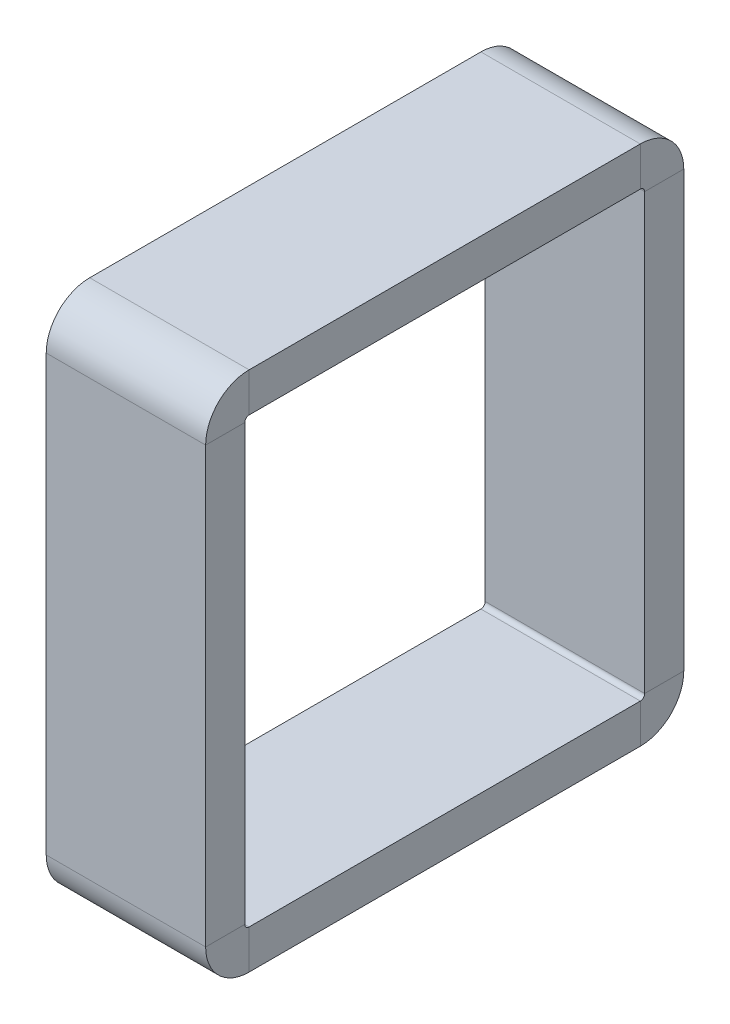
ISO-10303-21;
HEADER;
FILE_DESCRIPTION(('STEP AP214'),'2;1');
FILE_NAME('part.step','',(''),(''),'','','');
FILE_SCHEMA(('AUTOMOTIVE_DESIGN { 1 0 10303 214 1 1 1 1 }'));
ENDSEC;
DATA;
#1=APPLICATION_CONTEXT('core data for automotive mechanical design processes');
#2=APPLICATION_PROTOCOL_DEFINITION('international standard','automotive_design',2000,#1);
#3=PRODUCT_CONTEXT('',#1,'mechanical');
#4=PRODUCT('Part','Part','',(#3));
#5=PRODUCT_RELATED_PRODUCT_CATEGORY('part','',(#4));
#6=PRODUCT_DEFINITION_FORMATION('','',#4);
#7=PRODUCT_DEFINITION_CONTEXT('part definition',#1,'design');
#8=PRODUCT_DEFINITION('design','',#6,#7);
#9=PRODUCT_DEFINITION_SHAPE('','',#8);
#10=(LENGTH_UNIT() NAMED_UNIT(*) SI_UNIT(.MILLI.,.METRE.));
#11=(NAMED_UNIT(*) PLANE_ANGLE_UNIT() SI_UNIT($,.RADIAN.));
#12=(NAMED_UNIT(*) SI_UNIT($,.STERADIAN.) SOLID_ANGLE_UNIT());
#13=UNCERTAINTY_MEASURE_WITH_UNIT(LENGTH_MEASURE(1.E-05),#10,'distance_accuracy_value','');
#14=(GEOMETRIC_REPRESENTATION_CONTEXT(3) GLOBAL_UNCERTAINTY_ASSIGNED_CONTEXT((#13)) GLOBAL_UNIT_ASSIGNED_CONTEXT((#10,
#11,#12)) REPRESENTATION_CONTEXT('',''));
#15=CARTESIAN_POINT('',(0.,0.,0.));
#16=DIRECTION('',(0.,0.,1.));
#17=DIRECTION('',(1.,0.,0.));
#18=AXIS2_PLACEMENT_3D('',#15,#16,#17);
#19=CARTESIAN_POINT('',(3.71677795736335,0.75499913114187,-3.2461214549909));
#20=DIRECTION('',(-1.,1.74845553146952E-07,0.));
#21=DIRECTION('',(0.,8.74227765734758E-08,-1.));
#22=AXIS2_PLACEMENT_3D('',#19,#20,#21);
#23=PLANE('',#22);
#24=CARTESIAN_POINT('',(3.71677795648913,0.74999913157898,-3.25112145542801));
#25=DIRECTION('',(0.999999999999985,-1.74845553146949E-07,0.));
#26=DIRECTION('',(-1.74845553146948E-07,-0.999999999999981,-8.74265104755874E-08));
#27=AXIS2_PLACEMENT_3D('',#24,#25,#26);
#28=CIRCLE('',#27,0.00999999999999571);
#29=CARTESIAN_POINT('',(3.71677795474067,0.739999131578984,-3.25112145630224));
#30=VERTEX_POINT('',#29);
#31=CARTESIAN_POINT('',(3.71677795648913,0.749999132454212,-3.26112145542801));
#32=VERTEX_POINT('',#31);
#33=EDGE_CURVE('E11',#30,#32,#28,.T.);
#34=ORIENTED_EDGE('',*,*,#33,.F.);
#35=DIRECTION('',(1.74845555319994E-07,0.999999999999981,8.74227702585101E-08));
#36=VECTOR('',#35,1.);
#37=CARTESIAN_POINT('',(3.71677793900457,0.649999131579984,-3.25112146417129));
#38=LINE('',#37,#36);
#39=CARTESIAN_POINT('',(3.71677793900457,0.649999131579984,-3.25112146417029));
#40=VERTEX_POINT('',#39);
#41=EDGE_CURVE('E295',#40,#30,#38,.T.);
#42=ORIENTED_EDGE('',*,*,#41,.F.);
#43=CARTESIAN_POINT('',(3.71677795648913,0.749999131579652,-3.25112145542834));
#44=DIRECTION('',(-0.999999999999985,1.74845553146949E-07,0.));
#45=DIRECTION('',(0.,8.74165517753129E-08,-0.999999999999996));
#46=AXIS2_PLACEMENT_3D('',#43,#44,#45);
#47=CIRCLE('',#46,0.0999999999996649);
#48=CARTESIAN_POINT('',(3.71677795648913,0.749999140322262,-3.35112145542801));
#49=VERTEX_POINT('',#48);
#50=EDGE_CURVE('E292',#49,#40,#47,.T.);
#51=ORIENTED_EDGE('',*,*,#50,.F.);
#52=DIRECTION('',(0.,8.74227727247025E-08,-0.999999999999996));
#53=VECTOR('',#52,1.);
#54=CARTESIAN_POINT('',(3.71677795648913,0.749999132453212,-3.26112145542801));
#55=LINE('',#54,#53);
#56=EDGE_CURVE('E281',#32,#49,#55,.T.);
#57=ORIENTED_EDGE('',*,*,#56,.F.);
#58=EDGE_LOOP('',(#34,#42,#51,#57));
#59=FACE_BOUND('',#58,.T.);
#60=ADVANCED_FACE('F17',(#59),#23,.F.);
#61=CARTESIAN_POINT('',(3.35000013200835,0.754999195271342,-3.2461214549909));
#62=DIRECTION('',(-1.,1.74845553146952E-07,0.));
#63=DIRECTION('',(0.,8.74227765734758E-08,-1.));
#64=AXIS2_PLACEMENT_3D('',#61,#62,#63);
#65=PLANE('',#64);
#66=DIRECTION('',(0.,8.74227764254459E-08,-0.999999999999996));
#67=VECTOR('',#66,1.);
#68=CARTESIAN_POINT('',(3.35000013113413,0.749999196582683,-3.26112145542801));
#69=LINE('',#68,#67);
#70=CARTESIAN_POINT('',(3.35000013113413,0.749999196583683,-3.26112145542801));
#71=VERTEX_POINT('',#70);
#72=CARTESIAN_POINT('',(3.35000013113413,0.749999204451733,-3.35112145542801));
#73=VERTEX_POINT('',#72);
#74=EDGE_CURVE('E24',#71,#73,#69,.T.);
#75=ORIENTED_EDGE('',*,*,#74,.T.);
#76=CARTESIAN_POINT('',(3.35000013113413,0.749999195709119,-3.25112145542835));
#77=DIRECTION('',(-0.999999999999985,1.74845553146949E-07,0.));
#78=DIRECTION('',(0.,8.74161421030169E-08,-0.999999999999996));
#79=AXIS2_PLACEMENT_3D('',#76,#77,#78);
#80=CIRCLE('',#79,0.0999999999996649);
#81=CARTESIAN_POINT('',(3.35000011364957,0.649999195708455,-3.25112146417029));
#82=VERTEX_POINT('',#81);
#83=EDGE_CURVE('E290',#73,#82,#80,.T.);
#84=ORIENTED_EDGE('',*,*,#83,.T.);
#85=DIRECTION('',(-1.74845555319994E-07,-0.999999999999981,-8.74227702585101E-08));
#86=VECTOR('',#85,1.);
#87=CARTESIAN_POINT('',(3.35000012938567,0.739999195708455,-3.25112145630324));
#88=LINE('',#87,#86);
#89=CARTESIAN_POINT('',(3.35000012938567,0.739999195708455,-3.25112145630224));
#90=VERTEX_POINT('',#89);
#91=EDGE_CURVE('E284',#90,#82,#88,.T.);
#92=ORIENTED_EDGE('',*,*,#91,.F.);
#93=CARTESIAN_POINT('',(3.35000013113413,0.749999195708407,-3.25112145542806));
#94=DIRECTION('',(0.999999999999985,-1.74845553146949E-07,0.));
#95=DIRECTION('',(-1.74845553146948E-07,-0.999999999999981,-8.74178951449163E-08));
#96=AXIS2_PLACEMENT_3D('',#93,#94,#95);
#97=CIRCLE('',#96,0.00999999999999571);
#98=EDGE_CURVE('E274',#90,#71,#97,.T.);
#99=ORIENTED_EDGE('',*,*,#98,.T.);
#100=EDGE_LOOP('',(#75,#84,#92,#99));
#101=FACE_BOUND('',#100,.T.);
#102=ADVANCED_FACE('F409',(#101),#65,.T.);
#103=CARTESIAN_POINT('',(3.71677795648913,0.749999131579652,-3.25112145542834));
#104=DIRECTION('',(-1.,1.74845540855598E-07,0.));
#105=DIRECTION('',(-1.74845540855597E-07,-1.,-8.74227765734759E-08));
#106=AXIS2_PLACEMENT_3D('',#103,#104,#105);
#107=CYLINDRICAL_SURFACE('',#106,0.0999999999996679);
#108=ORIENTED_EDGE('',*,*,#50,.T.);
#109=DIRECTION('',(0.999999999999985,-1.74845553083486E-07,0.));
#110=VECTOR('',#109,1.);
#111=CARTESIAN_POINT('',(3.35000011364957,0.649999195709456,-3.25112146417129));
#112=LINE('',#111,#110);
#113=EDGE_CURVE('E287',#82,#40,#112,.T.);
#114=ORIENTED_EDGE('',*,*,#113,.F.);
#115=ORIENTED_EDGE('',*,*,#83,.F.);
#116=DIRECTION('',(-0.999999999999985,1.74845553083486E-07,0.));
#117=VECTOR('',#116,1.);
#118=CARTESIAN_POINT('',(3.71677795648913,0.749999140321261,-3.35112145542801));
#119=LINE('',#118,#117);
#120=EDGE_CURVE('E268',#49,#73,#119,.T.);
#121=ORIENTED_EDGE('',*,*,#120,.F.);
#122=EDGE_LOOP('',(#108,#114,#115,#121));
#123=FACE_BOUND('',#122,.T.);
#124=ADVANCED_FACE('F345',(#123),#107,.T.);
#125=CARTESIAN_POINT('',(3.71677795648913,0.74999913157898,-3.25112145542801));
#126=DIRECTION('',(1.,-1.74845430233419E-07,1.22913554664579E-13));
#127=DIRECTION('',(-1.74845430233408E-07,-1.,-8.74227765734759E-08));
#128=AXIS2_PLACEMENT_3D('',#125,#126,#127);
#129=CYLINDRICAL_SURFACE('',#128,0.00999999999999601);
#130=ORIENTED_EDGE('',*,*,#33,.T.);
#131=DIRECTION('',(-0.999999999999985,1.74844189739207E-07,0.));
#132=VECTOR('',#131,1.);
#133=CARTESIAN_POINT('',(3.71677795648913,0.749999132453461,-3.26112145542801));
#134=LINE('',#133,#132);
#135=EDGE_CURVE('E276',#32,#71,#134,.T.);
#136=ORIENTED_EDGE('',*,*,#135,.T.);
#137=ORIENTED_EDGE('',*,*,#98,.F.);
#138=DIRECTION('',(-0.999999999999985,1.74845553083486E-07,0.));
#139=VECTOR('',#138,1.);
#140=CARTESIAN_POINT('',(3.71677795474067,0.739999131578984,-3.25112145630324));
#141=LINE('',#140,#139);
#142=EDGE_CURVE('E262',#30,#90,#141,.T.);
#143=ORIENTED_EDGE('',*,*,#142,.F.);
#144=EDGE_LOOP('',(#130,#136,#137,#143));
#145=FACE_BOUND('',#144,.T.);
#146=ADVANCED_FACE('F304',(#145),#129,.F.);
#147=CARTESIAN_POINT('',(3.71677793900456,0.649999052899485,-2.35112146417129));
#148=DIRECTION('',(-1.,1.74845553146952E-07,0.));
#149=DIRECTION('',(1.74845553146952E-07,1.,8.74227765734759E-08));
#150=AXIS2_PLACEMENT_3D('',#147,#148,#149);
#151=PLANE('',#150);
#152=DIRECTION('',(0.,8.7422776548804E-08,-0.999999999999996));
#153=VECTOR('',#152,1.);
#154=CARTESIAN_POINT('',(3.71677793900456,0.649999052899485,-2.35112146417129));
#155=LINE('',#154,#153);
#156=CARTESIAN_POINT('',(3.71677793900356,0.649999052902485,-2.35112146416829));
#157=VERTEX_POINT('',#156);
#158=EDGE_CURVE('E278',#157,#40,#155,.T.);
#159=ORIENTED_EDGE('',*,*,#158,.T.);
#160=ORIENTED_EDGE('',*,*,#41,.T.);
#161=DIRECTION('',(0.,8.74227765488039E-08,-0.999999999999996));
#162=VECTOR('',#161,1.);
#163=CARTESIAN_POINT('',(3.71677795474066,0.739999052898485,-2.35112145630324));
#164=LINE('',#163,#162);
#165=CARTESIAN_POINT('',(3.71677795473966,0.739999052901485,-2.35112145630024));
#166=VERTEX_POINT('',#165);
#167=EDGE_CURVE('E265',#166,#30,#164,.T.);
#168=ORIENTED_EDGE('',*,*,#167,.F.);
#169=DIRECTION('',(1.74845550387524E-07,0.999999999999981,8.74333839915533E-08));
#170=VECTOR('',#169,1.);
#171=CARTESIAN_POINT('',(3.71677793900356,0.64999905290044,-2.35112146417224));
#172=LINE('',#171,#170);
#173=EDGE_CURVE('E147',#157,#166,#172,.T.);
#174=ORIENTED_EDGE('',*,*,#173,.F.);
#175=EDGE_LOOP('',(#159,#160,#168,#174));
#176=FACE_BOUND('',#175,.T.);
#177=ADVANCED_FACE('F297',(#176),#151,.F.);
#178=CARTESIAN_POINT('',(3.35000011364956,0.649999117028957,-2.35112146417129));
#179=DIRECTION('',(1.74845553146952E-07,1.,8.74227765734759E-08));
#180=DIRECTION('',(1.,-1.74845553146952E-07,0.));
#181=AXIS2_PLACEMENT_3D('',#178,#179,#180);
#182=PLANE('',#181);
#183=DIRECTION('',(0.,8.7422776548804E-08,-0.999999999999996));
#184=VECTOR('',#183,1.);
#185=CARTESIAN_POINT('',(3.35000011364956,0.649999117028957,-2.35112146417129));
#186=LINE('',#185,#184);
#187=CARTESIAN_POINT('',(3.35000011365056,0.649999117031957,-2.35112146416829));
#188=VERTEX_POINT('',#187);
#189=EDGE_CURVE('E271',#188,#82,#186,.T.);
#190=ORIENTED_EDGE('',*,*,#189,.T.);
#191=ORIENTED_EDGE('',*,*,#113,.T.);
#192=ORIENTED_EDGE('',*,*,#158,.F.);
#193=DIRECTION('',(0.999999999999985,-1.74845553083486E-07,0.));
#194=VECTOR('',#193,1.);
#195=CARTESIAN_POINT('',(3.35000011364956,0.649999117028957,-2.35112146417129));
#196=LINE('',#195,#194);
#197=EDGE_CURVE('E255',#188,#157,#196,.T.);
#198=ORIENTED_EDGE('',*,*,#197,.F.);
#199=EDGE_LOOP('',(#190,#191,#192,#198));
#200=FACE_BOUND('',#199,.T.);
#201=ADVANCED_FACE('F342',(#200),#182,.F.);
#202=CARTESIAN_POINT('',(3.71677795474066,0.739999052898485,-2.35112145630324));
#203=DIRECTION('',(-1.74845553146952E-07,-1.,-8.74227765734759E-08));
#204=DIRECTION('',(-1.,1.74845553146952E-07,0.));
#205=AXIS2_PLACEMENT_3D('',#202,#203,#204);
#206=PLANE('',#205);
#207=ORIENTED_EDGE('',*,*,#167,.T.);
#208=ORIENTED_EDGE('',*,*,#142,.T.);
#209=DIRECTION('',(0.,8.74227765488039E-08,-0.999999999999996));
#210=VECTOR('',#209,1.);
#211=CARTESIAN_POINT('',(3.35000012938566,0.739999117027957,-2.35112145630324));
#212=LINE('',#211,#210);
#213=CARTESIAN_POINT('',(3.35000012938666,0.739999117030957,-2.35112145630024));
#214=VERTEX_POINT('',#213);
#215=EDGE_CURVE('E259',#214,#90,#212,.T.);
#216=ORIENTED_EDGE('',*,*,#215,.F.);
#217=DIRECTION('',(-0.999999999999985,1.74845553083486E-07,0.));
#218=VECTOR('',#217,1.);
#219=CARTESIAN_POINT('',(3.71677795474066,0.739999052898485,-2.35112145630324));
#220=LINE('',#219,#218);
#221=EDGE_CURVE('E251',#166,#214,#220,.T.);
#222=ORIENTED_EDGE('',*,*,#221,.F.);
#223=EDGE_LOOP('',(#207,#208,#216,#222));
#224=FACE_BOUND('',#223,.T.);
#225=ADVANCED_FACE('F301',(#224),#206,.F.);
#226=CARTESIAN_POINT('',(3.35000012938566,0.739999117027957,-2.35112145630324));
#227=DIRECTION('',(1.,-1.74845553146952E-07,0.));
#228=DIRECTION('',(-1.74845553146952E-07,-1.,-8.74227765734759E-08));
#229=AXIS2_PLACEMENT_3D('',#226,#227,#228);
#230=PLANE('',#229);
#231=ORIENTED_EDGE('',*,*,#215,.T.);
#232=ORIENTED_EDGE('',*,*,#91,.T.);
#233=ORIENTED_EDGE('',*,*,#189,.F.);
#234=DIRECTION('',(-1.7484555038515E-07,-0.999999999999981,-8.74223508406634E-08));
#235=VECTOR('',#234,1.);
#236=CARTESIAN_POINT('',(3.35000012938666,0.739999117028224,-2.35112145630328));
#237=LINE('',#236,#235);
#238=EDGE_CURVE('E242',#214,#188,#237,.T.);
#239=ORIENTED_EDGE('',*,*,#238,.F.);
#240=EDGE_LOOP('',(#231,#232,#233,#239));
#241=FACE_BOUND('',#240,.T.);
#242=ADVANCED_FACE('F308',(#241),#230,.F.);
#243=CARTESIAN_POINT('',(3.71677814007696,1.7999991446924,-3.4011213636351));
#244=DIRECTION('',(1.,-1.74845553146952E-07,0.));
#245=DIRECTION('',(0.,-8.74227765734759E-08,1.));
#246=AXIS2_PLACEMENT_3D('',#243,#244,#245);
#247=PLANE('',#246);
#248=ORIENTED_EDGE('',*,*,#56,.T.);
#249=DIRECTION('',(1.74845553146948E-07,0.999999999999981,8.7420776395673E-08));
#250=VECTOR('',#249,1.);
#251=CARTESIAN_POINT('',(3.71677795648913,0.749999140321262,-3.35112145542801));
#252=LINE('',#251,#250);
#253=CARTESIAN_POINT('',(3.71677813133468,1.74999914032026,-3.35112136800623));
#254=VERTEX_POINT('',#253);
#255=EDGE_CURVE('E253',#49,#254,#252,.T.);
#256=ORIENTED_EDGE('',*,*,#255,.T.);
#257=DIRECTION('',(0.,-8.74116680263222E-08,0.999999999999996));
#258=VECTOR('',#257,1.);
#259=CARTESIAN_POINT('',(3.71677813133468,1.74999914032126,-3.35112136800723));
#260=LINE('',#259,#258);
#261=CARTESIAN_POINT('',(3.71677813133368,1.74999913245321,-3.26112136800623));
#262=VERTEX_POINT('',#261);
#263=EDGE_CURVE('E245',#254,#262,#260,.T.);
#264=ORIENTED_EDGE('',*,*,#263,.T.);
#265=DIRECTION('',(-1.74845553146774E-07,-0.999999999999981,-8.74217769285754E-08));
#266=VECTOR('',#265,1.);
#267=CARTESIAN_POINT('',(3.71677813133468,1.74999913245421,-3.26112136800623));
#268=LINE('',#267,#266);
#269=EDGE_CURVE('E233',#262,#32,#268,.T.);
#270=ORIENTED_EDGE('',*,*,#269,.T.);
#271=EDGE_LOOP('',(#248,#256,#264,#270));
#272=FACE_BOUND('',#271,.T.);
#273=ADVANCED_FACE('F350',(#272),#247,.T.);
#274=CARTESIAN_POINT('',(3.71677795648913,0.749999140321261,-3.35112145542801));
#275=DIRECTION('',(0.,-8.74207763956747E-08,1.));
#276=DIRECTION('',(1.74845553146952E-07,1.,8.74207763956747E-08));
#277=AXIS2_PLACEMENT_3D('',#274,#275,#276);
#278=PLANE('',#277);
#279=ORIENTED_EDGE('',*,*,#120,.T.);
#280=DIRECTION('',(1.74845553146948E-07,0.999999999999981,8.7420776395673E-08));
#281=VECTOR('',#280,1.);
#282=CARTESIAN_POINT('',(3.35000013113413,0.749999204450733,-3.35112145542801));
#283=LINE('',#282,#281);
#284=CARTESIAN_POINT('',(3.35000030598068,1.74999920444973,-3.35112136800623));
#285=VERTEX_POINT('',#284);
#286=EDGE_CURVE('E247',#73,#285,#283,.T.);
#287=ORIENTED_EDGE('',*,*,#286,.T.);
#288=DIRECTION('',(-0.999999999999985,1.74845553083486E-07,0.));
#289=VECTOR('',#288,1.);
#290=CARTESIAN_POINT('',(3.71677813133468,1.74999914032126,-3.35112136800723));
#291=LINE('',#290,#289);
#292=EDGE_CURVE('E236',#254,#285,#291,.T.);
#293=ORIENTED_EDGE('',*,*,#292,.F.);
#294=ORIENTED_EDGE('',*,*,#255,.F.);
#295=EDGE_LOOP('',(#279,#287,#293,#294));
#296=FACE_BOUND('',#295,.T.);
#297=ADVANCED_FACE('F364',(#296),#278,.F.);
#298=CARTESIAN_POINT('',(3.71677813133468,1.74999913245421,-3.26112136800623));
#299=DIRECTION('',(0.,8.74217769286645E-08,-1.));
#300=DIRECTION('',(-1.74845553146952E-07,-1.,-8.74217769286645E-08));
#301=AXIS2_PLACEMENT_3D('',#298,#299,#300);
#302=PLANE('',#301);
#303=DIRECTION('',(-0.999999999999985,1.74844189739207E-07,0.));
#304=VECTOR('',#303,1.);
#305=CARTESIAN_POINT('',(3.71677813133468,1.74999913245396,-3.26112136800623));
#306=LINE('',#305,#304);
#307=CARTESIAN_POINT('',(3.35000030598068,1.74999919658168,-3.26112136800623));
#308=VERTEX_POINT('',#307);
#309=EDGE_CURVE('E249',#262,#308,#306,.T.);
#310=ORIENTED_EDGE('',*,*,#309,.T.);
#311=DIRECTION('',(-1.74845553146861E-07,-0.999999999999981,-8.74217769286191E-08));
#312=VECTOR('',#311,1.);
#313=CARTESIAN_POINT('',(3.35000030597968,1.74999919658293,-3.26112136800623));
#314=LINE('',#313,#312);
#315=EDGE_CURVE('E239',#308,#71,#314,.T.);
#316=ORIENTED_EDGE('',*,*,#315,.T.);
#317=ORIENTED_EDGE('',*,*,#135,.F.);
#318=ORIENTED_EDGE('',*,*,#269,.F.);
#319=EDGE_LOOP('',(#310,#316,#317,#318));
#320=FACE_BOUND('',#319,.T.);
#321=ADVANCED_FACE('F355',(#320),#302,.F.);
#322=CARTESIAN_POINT('',(3.35000031472196,1.79999920882187,-3.4011213636351));
#323=DIRECTION('',(1.,-1.74845553146952E-07,0.));
#324=DIRECTION('',(0.,-8.74227765734759E-08,1.));
#325=AXIS2_PLACEMENT_3D('',#322,#323,#324);
#326=PLANE('',#325);
#327=ORIENTED_EDGE('',*,*,#315,.F.);
#328=DIRECTION('',(0.,-8.74121639268677E-08,0.999999999999996));
#329=VECTOR('',#328,1.);
#330=CARTESIAN_POINT('',(3.35000030597968,1.74999920444978,-3.35112136800628));
#331=LINE('',#330,#329);
#332=EDGE_CURVE('E228',#285,#308,#331,.T.);
#333=ORIENTED_EDGE('',*,*,#332,.F.);
#334=ORIENTED_EDGE('',*,*,#286,.F.);
#335=ORIENTED_EDGE('',*,*,#74,.F.);
#336=EDGE_LOOP('',(#327,#333,#334,#335));
#337=FACE_BOUND('',#336,.T.);
#338=ADVANCED_FACE('F361',(#337),#326,.F.);
#339=CARTESIAN_POINT('',(3.71677814969346,1.85499913114087,-3.24612135882784));
#340=DIRECTION('',(-1.,1.74845553146952E-07,0.));
#341=DIRECTION('',(0.,8.74227765734759E-08,-1.));
#342=AXIS2_PLACEMENT_3D('',#339,#340,#341);
#343=PLANE('',#342);
#344=CARTESIAN_POINT('',(3.71677813133468,1.74999913157899,-3.25112136800624));
#345=DIRECTION('',(0.999999999999985,-1.74845553146949E-07,0.));
#346=DIRECTION('',(0.,8.74206040890757E-08,-0.999999999999996));
#347=AXIS2_PLACEMENT_3D('',#344,#345,#346);
#348=CIRCLE('',#347,0.0099999999999977);
#349=CARTESIAN_POINT('',(3.71677813308214,1.75999913157898,-3.25112136713201));
#350=VERTEX_POINT('',#349);
#351=EDGE_CURVE('E231',#262,#350,#348,.T.);
#352=ORIENTED_EDGE('',*,*,#351,.F.);
#353=ORIENTED_EDGE('',*,*,#263,.F.);
#354=CARTESIAN_POINT('',(3.71677813133468,1.74999913157919,-3.25112136800744));
#355=DIRECTION('',(-0.999999999999985,1.74845553146949E-07,0.));
#356=DIRECTION('',(1.74845553146948E-07,0.999999999999981,8.74250316595358E-08));
#357=AXIS2_PLACEMENT_3D('',#354,#355,#356);
#358=CIRCLE('',#357,0.099999999998794);
#359=CARTESIAN_POINT('',(3.71677814881823,1.84999913157798,-3.25112135926396));
#360=VERTEX_POINT('',#359);
#361=EDGE_CURVE('E225',#360,#254,#358,.T.);
#362=ORIENTED_EDGE('',*,*,#361,.F.);
#363=DIRECTION('',(1.74845555319994E-07,0.999999999999981,8.74116680282638E-08));
#364=VECTOR('',#363,1.);
#365=CARTESIAN_POINT('',(3.71677813308313,1.75999913157898,-3.25112136713201));
#366=LINE('',#365,#364);
#367=EDGE_CURVE('E215',#350,#360,#366,.T.);
#368=ORIENTED_EDGE('',*,*,#367,.F.);
#369=EDGE_LOOP('',(#352,#353,#362,#368));
#370=FACE_BOUND('',#369,.T.);
#371=ADVANCED_FACE('F372',(#370),#343,.F.);
#372=CARTESIAN_POINT('',(3.71677813133468,1.74999913157919,-3.25112136800744));
#373=DIRECTION('',(-1.,1.74845565438307E-07,0.));
#374=DIRECTION('',(-1.74845565438306E-07,-1.,-8.74227765734759E-08));
#375=AXIS2_PLACEMENT_3D('',#372,#373,#374);
#376=CYLINDRICAL_SURFACE('',#375,0.0999999999987971);
#377=ORIENTED_EDGE('',*,*,#361,.T.);
#378=ORIENTED_EDGE('',*,*,#292,.T.);
#379=CARTESIAN_POINT('',(3.35000030597968,1.74999919570866,-3.25112136800744));
#380=DIRECTION('',(-0.999999999999985,1.74845553146949E-07,0.));
#381=DIRECTION('',(1.74845553146948E-07,0.999999999999981,8.74250760684568E-08));
#382=AXIS2_PLACEMENT_3D('',#379,#380,#381);
#383=CIRCLE('',#382,0.099999999998794);
#384=CARTESIAN_POINT('',(3.35000032346524,1.84999919570746,-3.25112135926396));
#385=VERTEX_POINT('',#384);
#386=EDGE_CURVE('E218',#385,#285,#383,.T.);
#387=ORIENTED_EDGE('',*,*,#386,.F.);
#388=DIRECTION('',(-0.999999999999985,1.74845553083487E-07,0.));
#389=VECTOR('',#388,1.);
#390=CARTESIAN_POINT('',(3.71677814881923,1.84999913157798,-3.25112135926496));
#391=LINE('',#390,#389);
#392=EDGE_CURVE('E209',#360,#385,#391,.T.);
#393=ORIENTED_EDGE('',*,*,#392,.F.);
#394=EDGE_LOOP('',(#377,#378,#387,#393));
#395=FACE_BOUND('',#394,.T.);
#396=ADVANCED_FACE('F368',(#395),#376,.T.);
#397=CARTESIAN_POINT('',(3.71677813133468,1.74999913157899,-3.25112136800624));
#398=DIRECTION('',(1.,-1.74845676060506E-07,1.22913533173703E-13));
#399=DIRECTION('',(-1.74845676060496E-07,-1.,-8.74227765734759E-08));
#400=AXIS2_PLACEMENT_3D('',#397,#398,#399);
#401=CYLINDRICAL_SURFACE('',#400,0.00999999999999801);
#402=ORIENTED_EDGE('',*,*,#351,.T.);
#403=DIRECTION('',(-0.999999999999985,1.74842826394926E-07,0.));
#404=VECTOR('',#403,1.);
#405=CARTESIAN_POINT('',(3.71677813308314,1.75999913157898,-3.25112136713201));
#406=LINE('',#405,#404);
#407=CARTESIAN_POINT('',(3.35000030772914,1.75999919570746,-3.25112136713201));
#408=VERTEX_POINT('',#407);
#409=EDGE_CURVE('E221',#350,#408,#406,.T.);
#410=ORIENTED_EDGE('',*,*,#409,.T.);
#411=CARTESIAN_POINT('',(3.35000030597968,1.7499991957085,-3.25112136800628));
#412=DIRECTION('',(0.999999999999985,-1.74845553146949E-07,0.));
#413=DIRECTION('',(0.,8.73160876935413E-08,-0.999999999999996));
#414=AXIS2_PLACEMENT_3D('',#411,#412,#413);
#415=CIRCLE('',#414,0.0099999999999977);
#416=EDGE_CURVE('E212',#308,#408,#415,.T.);
#417=ORIENTED_EDGE('',*,*,#416,.F.);
#418=ORIENTED_EDGE('',*,*,#309,.F.);
#419=EDGE_LOOP('',(#402,#410,#417,#418));
#420=FACE_BOUND('',#419,.T.);
#421=ADVANCED_FACE('F374',(#420),#401,.F.);
#422=CARTESIAN_POINT('',(3.35000032433846,1.85499919527034,-3.24612135882784));
#423=DIRECTION('',(-1.,1.74845553146952E-07,0.));
#424=DIRECTION('',(0.,8.74227765734759E-08,-1.));
#425=AXIS2_PLACEMENT_3D('',#422,#423,#424);
#426=PLANE('',#425);
#427=DIRECTION('',(1.74845550383717E-07,0.999999999999981,8.74106564907539E-08));
#428=VECTOR('',#427,1.);
#429=CARTESIAN_POINT('',(3.35000030772814,1.75999919570745,-3.25112136713192));
#430=LINE('',#429,#428);
#431=EDGE_CURVE('E223',#408,#385,#430,.T.);
#432=ORIENTED_EDGE('',*,*,#431,.T.);
#433=ORIENTED_EDGE('',*,*,#386,.T.);
#434=ORIENTED_EDGE('',*,*,#332,.T.);
#435=ORIENTED_EDGE('',*,*,#416,.T.);
#436=EDGE_LOOP('',(#432,#433,#434,#435));
#437=FACE_BOUND('',#436,.T.);
#438=ADVANCED_FACE('F377',(#437),#426,.T.);
#439=CARTESIAN_POINT('',(3.71677815668729,1.89499913551501,-3.29612135533093));
#440=DIRECTION('',(1.,-1.74845553146952E-07,0.));
#441=DIRECTION('',(0.,-8.74227765734759E-08,1.));
#442=AXIS2_PLACEMENT_3D('',#439,#440,#441);
#443=PLANE('',#442);
#444=ORIENTED_EDGE('',*,*,#367,.T.);
#445=DIRECTION('',(0.,-8.74194432892096E-08,0.999999999999996));
#446=VECTOR('',#445,1.);
#447=CARTESIAN_POINT('',(3.71677814881923,1.84999913157798,-3.25112135926496));
#448=LINE('',#447,#446);
#449=CARTESIAN_POINT('',(3.71677814881822,1.84999905290048,-2.35112135926596));
#450=VERTEX_POINT('',#449);
#451=EDGE_CURVE('E207',#360,#450,#448,.T.);
#452=ORIENTED_EDGE('',*,*,#451,.T.);
#453=DIRECTION('',(-1.74845555318051E-07,-0.999999999999981,-8.74227850605123E-08));
#454=VECTOR('',#453,1.);
#455=CARTESIAN_POINT('',(3.71677814881922,1.84999905290048,-2.35112135926496));
#456=LINE('',#455,#454);
#457=CARTESIAN_POINT('',(3.71677813308212,1.75999905290048,-2.35112136713301));
#458=VERTEX_POINT('',#457);
#459=EDGE_CURVE('E201',#450,#458,#456,.T.);
#460=ORIENTED_EDGE('',*,*,#459,.T.);
#461=DIRECTION('',(0.,8.74205547459126E-08,-0.999999999999996));
#462=VECTOR('',#461,1.);
#463=CARTESIAN_POINT('',(3.71677813308312,1.75999905290048,-2.35112136713301));
#464=LINE('',#463,#462);
#465=EDGE_CURVE('E192',#458,#350,#464,.T.);
#466=ORIENTED_EDGE('',*,*,#465,.T.);
#467=EDGE_LOOP('',(#444,#452,#460,#466));
#468=FACE_BOUND('',#467,.T.);
#469=ADVANCED_FACE('F397',(#468),#443,.T.);
#470=CARTESIAN_POINT('',(3.71677814881923,1.84999913157798,-3.25112135926496));
#471=DIRECTION('',(-1.74845553146952E-07,-1.,-8.74194431905235E-08));
#472=DIRECTION('',(0.,-8.74194431905235E-08,1.));
#473=AXIS2_PLACEMENT_3D('',#470,#471,#472);
#474=PLANE('',#473);
#475=ORIENTED_EDGE('',*,*,#392,.T.);
#476=DIRECTION('',(0.,-8.74194432892097E-08,0.999999999999996));
#477=VECTOR('',#476,1.);
#478=CARTESIAN_POINT('',(3.35000032346424,1.84999919570746,-3.25112135926496));
#479=LINE('',#478,#477);
#480=CARTESIAN_POINT('',(3.35000032346522,1.84999911702996,-2.35112135926596));
#481=VERTEX_POINT('',#480);
#482=EDGE_CURVE('E203',#385,#481,#479,.T.);
#483=ORIENTED_EDGE('',*,*,#482,.T.);
#484=DIRECTION('',(-0.999999999999985,1.74845553083486E-07,0.));
#485=VECTOR('',#484,1.);
#486=CARTESIAN_POINT('',(3.71677814881922,1.84999905290048,-2.35112135926496));
#487=LINE('',#486,#485);
#488=EDGE_CURVE('E195',#450,#481,#487,.T.);
#489=ORIENTED_EDGE('',*,*,#488,.F.);
#490=ORIENTED_EDGE('',*,*,#451,.F.);
#491=EDGE_LOOP('',(#475,#483,#489,#490));
#492=FACE_BOUND('',#491,.T.);
#493=ADVANCED_FACE('F381',(#492),#474,.F.);
#494=CARTESIAN_POINT('',(3.71677813308312,1.75999905290048,-2.35112136713301));
#495=DIRECTION('',(1.74842826458391E-07,1.,8.7420554400413E-08));
#496=DIRECTION('',(0.,8.7420554400413E-08,-1.));
#497=AXIS2_PLACEMENT_3D('',#494,#495,#496);
#498=PLANE('',#497);
#499=DIRECTION('',(-0.999999999999985,1.74842826394926E-07,0.));
#500=VECTOR('',#499,1.);
#501=CARTESIAN_POINT('',(3.71677813308312,1.75999905290048,-2.35112136713301));
#502=LINE('',#501,#500);
#503=CARTESIAN_POINT('',(3.35000030772912,1.75999911702996,-2.35112136713301));
#504=VERTEX_POINT('',#503);
#505=EDGE_CURVE('E205',#458,#504,#502,.T.);
#506=ORIENTED_EDGE('',*,*,#505,.T.);
#507=DIRECTION('',(0.,8.74205544991963E-08,-0.999999999999996));
#508=VECTOR('',#507,1.);
#509=CARTESIAN_POINT('',(3.35000030772812,1.75999911702896,-2.35112136713301));
#510=LINE('',#509,#508);
#511=EDGE_CURVE('E198',#504,#408,#510,.T.);
#512=ORIENTED_EDGE('',*,*,#511,.T.);
#513=ORIENTED_EDGE('',*,*,#409,.F.);
#514=ORIENTED_EDGE('',*,*,#465,.F.);
#515=EDGE_LOOP('',(#506,#512,#513,#514));
#516=FACE_BOUND('',#515,.T.);
#517=ADVANCED_FACE('F398',(#516),#498,.F.);
#518=CARTESIAN_POINT('',(3.35000033133229,1.89499919964448,-3.29612135533093));
#519=DIRECTION('',(1.,-1.74845553146952E-07,0.));
#520=DIRECTION('',(0.,-8.74227765734759E-08,1.));
#521=AXIS2_PLACEMENT_3D('',#518,#519,#520);
#522=PLANE('',#521);
#523=ORIENTED_EDGE('',*,*,#511,.F.);
#524=DIRECTION('',(-1.74845550383726E-07,-0.999999999999981,-8.74227751918632E-08));
#525=VECTOR('',#524,1.);
#526=CARTESIAN_POINT('',(3.35000032346522,1.84999911702996,-2.35112135926496));
#527=LINE('',#526,#525);
#528=EDGE_CURVE('E187',#481,#504,#527,.T.);
#529=ORIENTED_EDGE('',*,*,#528,.F.);
#530=ORIENTED_EDGE('',*,*,#482,.F.);
#531=ORIENTED_EDGE('',*,*,#431,.F.);
#532=EDGE_LOOP('',(#523,#529,#530,#531));
#533=FACE_BOUND('',#532,.T.);
#534=ADVANCED_FACE('F385',(#533),#522,.F.);
#535=CARTESIAN_POINT('',(3.71677814969245,1.85499904372109,-2.24612135882884));
#536=DIRECTION('',(-1.,1.74845553146952E-07,0.));
#537=DIRECTION('',(0.,8.74227765734759E-08,-1.));
#538=AXIS2_PLACEMENT_3D('',#535,#536,#537);
#539=PLANE('',#538);
#540=CARTESIAN_POINT('',(3.71677813133367,1.74999905290049,-2.35112136800723));
#541=DIRECTION('',(0.999999999999985,-1.74845553146949E-07,0.));
#542=DIRECTION('',(1.74845553146948E-07,0.999999999999981,8.74226024905097E-08));
#543=AXIS2_PLACEMENT_3D('',#540,#541,#542);
#544=CIRCLE('',#543,0.00999999999999926);
#545=CARTESIAN_POINT('',(3.71677813133367,1.74999905202526,-2.34112136800723));
#546=VERTEX_POINT('',#545);
#547=EDGE_CURVE('E190',#458,#546,#544,.T.);
#548=ORIENTED_EDGE('',*,*,#547,.F.);
#549=ORIENTED_EDGE('',*,*,#459,.F.);
#550=CARTESIAN_POINT('',(3.71677813133367,1.74999905290051,-2.35112136800821));
#551=DIRECTION('',(-0.999999999999985,1.74845553146949E-07,0.));
#552=DIRECTION('',(0.,-8.74230199343854E-08,0.999999999999996));
#553=AXIS2_PLACEMENT_3D('',#550,#551,#552);
#554=CIRCLE('',#553,0.0999999999999726);
#555=CARTESIAN_POINT('',(3.71677813133366,1.74999904415821,-2.25112136800824));
#556=VERTEX_POINT('',#555);
#557=EDGE_CURVE('E184',#556,#450,#554,.T.);
#558=ORIENTED_EDGE('',*,*,#557,.F.);
#559=DIRECTION('',(0.,-8.74111622599545E-08,0.999999999999996));
#560=VECTOR('',#559,1.);
#561=CARTESIAN_POINT('',(3.71677813133367,1.74999905202621,-2.34112136800728));
#562=LINE('',#561,#560);
#563=EDGE_CURVE('E176',#546,#556,#562,.T.);
#564=ORIENTED_EDGE('',*,*,#563,.F.);
#565=EDGE_LOOP('',(#548,#549,#558,#564));
#566=FACE_BOUND('',#565,.T.);
#567=ADVANCED_FACE('F395',(#566),#539,.F.);
#568=CARTESIAN_POINT('',(3.71677813133366,1.74999905290051,-2.35112136800821));
#569=DIRECTION('',(-1.,1.74845565438305E-07,0.));
#570=DIRECTION('',(-1.74845565438306E-07,-1.,-8.74227765734759E-08));
#571=AXIS2_PLACEMENT_3D('',#568,#569,#570);
#572=CYLINDRICAL_SURFACE('',#571,0.0999999999999757);
#573=ORIENTED_EDGE('',*,*,#557,.T.);
#574=ORIENTED_EDGE('',*,*,#488,.T.);
#575=CARTESIAN_POINT('',(3.35000030598067,1.74999911702999,-2.35112136800821));
#576=DIRECTION('',(-0.999999999999985,1.74845553146949E-07,0.));
#577=DIRECTION('',(0.,-8.74230621228603E-08,0.999999999999996));
#578=AXIS2_PLACEMENT_3D('',#575,#576,#577);
#579=CIRCLE('',#578,0.0999999999999726);
#580=CARTESIAN_POINT('',(3.35000030598066,1.74999910828768,-2.25112136800824));
#581=VERTEX_POINT('',#580);
#582=EDGE_CURVE('E178',#581,#481,#579,.T.);
#583=ORIENTED_EDGE('',*,*,#582,.F.);
#584=DIRECTION('',(-0.999999999999985,1.7484418974016E-07,0.));
#585=VECTOR('',#584,1.);
#586=CARTESIAN_POINT('',(3.71677813133366,1.74999904415896,-2.25112136800824));
#587=LINE('',#586,#585);
#588=EDGE_CURVE('E167',#556,#581,#587,.T.);
#589=ORIENTED_EDGE('',*,*,#588,.F.);
#590=EDGE_LOOP('',(#573,#574,#583,#589));
#591=FACE_BOUND('',#590,.T.);
#592=ADVANCED_FACE('F335',(#591),#572,.T.);
#593=CARTESIAN_POINT('',(3.71677813133366,1.74999905290049,-2.35112136800723));
#594=DIRECTION('',(1.,-1.74845676060485E-07,-1.22913554664586E-13));
#595=DIRECTION('',(-1.74845676060496E-07,-1.,-8.74227765734759E-08));
#596=AXIS2_PLACEMENT_3D('',#593,#594,#595);
#597=CYLINDRICAL_SURFACE('',#596,0.00999999999999957);
#598=ORIENTED_EDGE('',*,*,#547,.T.);
#599=DIRECTION('',(-0.999999999999985,1.7484555308444E-07,0.));
#600=VECTOR('',#599,1.);
#601=CARTESIAN_POINT('',(3.71677813133367,1.74999905202626,-2.34112136800723));
#602=LINE('',#601,#600);
#603=CARTESIAN_POINT('',(3.35000030598067,1.74999911615473,-2.34112136800723));
#604=VERTEX_POINT('',#603);
#605=EDGE_CURVE('E158',#546,#604,#602,.T.);
#606=ORIENTED_EDGE('',*,*,#605,.T.);
#607=CARTESIAN_POINT('',(3.35000030598067,1.74999911703,-2.35112136800719));
#608=DIRECTION('',(0.999999999999985,-1.74845553146949E-07,0.));
#609=DIRECTION('',(1.74845553146948E-07,0.999999999999981,8.74180727805692E-08));
#610=AXIS2_PLACEMENT_3D('',#607,#608,#609);
#611=CIRCLE('',#610,0.00999999999999926);
#612=EDGE_CURVE('E173',#504,#604,#611,.T.);
#613=ORIENTED_EDGE('',*,*,#612,.F.);
#614=ORIENTED_EDGE('',*,*,#505,.F.);
#615=EDGE_LOOP('',(#598,#606,#613,#614));
#616=FACE_BOUND('',#615,.T.);
#617=ADVANCED_FACE('F389',(#616),#597,.F.);
#618=CARTESIAN_POINT('',(3.35000032433945,1.85499910785057,-2.24612135882884));
#619=DIRECTION('',(-1.,1.74845553146952E-07,0.));
#620=DIRECTION('',(0.,8.74227765734759E-08,-1.));
#621=AXIS2_PLACEMENT_3D('',#618,#619,#620);
#622=PLANE('',#621);
#623=DIRECTION('',(0.,-8.74227776599981E-08,0.999999999999996));
#624=VECTOR('',#623,1.);
#625=CARTESIAN_POINT('',(3.35000030598067,1.74999911615573,-2.34112136800724));
#626=LINE('',#625,#624);
#627=EDGE_CURVE('E182',#604,#581,#626,.T.);
#628=ORIENTED_EDGE('',*,*,#627,.T.);
#629=ORIENTED_EDGE('',*,*,#582,.T.);
#630=ORIENTED_EDGE('',*,*,#528,.T.);
#631=ORIENTED_EDGE('',*,*,#612,.T.);
#632=EDGE_LOOP('',(#628,#629,#630,#631));
#633=FACE_BOUND('',#632,.T.);
#634=ADVANCED_FACE('F331',(#633),#622,.T.);
#635=CARTESIAN_POINT('',(3.71677814007594,1.7999990563984,-2.3911213636361));
#636=DIRECTION('',(1.,-1.74845553146952E-07,0.));
#637=DIRECTION('',(0.,-8.74227765734759E-08,1.));
#638=AXIS2_PLACEMENT_3D('',#635,#636,#637);
#639=PLANE('',#638);
#640=ORIENTED_EDGE('',*,*,#563,.T.);
#641=DIRECTION('',(-1.74845553146788E-07,-0.999999999999981,-8.74187473519928E-08));
#642=VECTOR('',#641,1.);
#643=CARTESIAN_POINT('',(3.71677813133366,1.74999904415913,-2.25112136800826));
#644=LINE('',#643,#642);
#645=CARTESIAN_POINT('',(3.71677795648811,0.749999044159207,-2.25112145542701));
#646=VERTEX_POINT('',#645);
#647=EDGE_CURVE('E135',#556,#646,#644,.T.);
#648=ORIENTED_EDGE('',*,*,#647,.T.);
#649=DIRECTION('',(0.,8.74231428002584E-08,-0.999999999999996));
#650=VECTOR('',#649,1.);
#651=CARTESIAN_POINT('',(3.71677795648811,0.749999044158174,-2.25112145542726));
#652=LINE('',#651,#650);
#653=CARTESIAN_POINT('',(3.71677795648811,0.749999052027257,-2.34112145542601));
#654=VERTEX_POINT('',#653);
#655=EDGE_CURVE('E127',#646,#654,#652,.T.);
#656=ORIENTED_EDGE('',*,*,#655,.T.);
#657=DIRECTION('',(1.74845553146948E-07,0.999999999999981,8.74188672561595E-08));
#658=VECTOR('',#657,1.);
#659=CARTESIAN_POINT('',(3.71677795648811,0.749999052026253,-2.3411214554261));
#660=LINE('',#659,#658);
#661=EDGE_CURVE('E132',#654,#546,#660,.T.);
#662=ORIENTED_EDGE('',*,*,#661,.T.);
#663=EDGE_LOOP('',(#640,#648,#656,#662));
#664=FACE_BOUND('',#663,.T.);
#665=ADVANCED_FACE('F130',(#664),#639,.T.);
#666=CARTESIAN_POINT('',(3.71677813133366,1.74999904415921,-2.25112136800824));
#667=DIRECTION('',(0.,8.74187762178735E-08,-1.));
#668=DIRECTION('',(-1.74845553146952E-07,-1.,-8.74187762178735E-08));
#669=AXIS2_PLACEMENT_3D('',#666,#667,#668);
#670=PLANE('',#669);
#671=ORIENTED_EDGE('',*,*,#588,.T.);
#672=DIRECTION('',(-1.74845553146861E-07,-0.999999999999981,-8.74187762178281E-08));
#673=VECTOR('',#672,1.);
#674=CARTESIAN_POINT('',(3.35000030598067,1.74999910828793,-2.25112136800824));
#675=LINE('',#674,#673);
#676=CARTESIAN_POINT('',(3.35000013113511,0.749999108288679,-2.25112145542701));
#677=VERTEX_POINT('',#676);
#678=EDGE_CURVE('E139',#581,#677,#675,.T.);
#679=ORIENTED_EDGE('',*,*,#678,.T.);
#680=DIRECTION('',(-0.999999999999985,1.7484418974016E-07,0.));
#681=VECTOR('',#680,1.);
#682=CARTESIAN_POINT('',(3.71677795648811,0.749999044158457,-2.25112145542701));
#683=LINE('',#682,#681);
#684=EDGE_CURVE('E159',#646,#677,#683,.T.);
#685=ORIENTED_EDGE('',*,*,#684,.F.);
#686=ORIENTED_EDGE('',*,*,#647,.F.);
#687=EDGE_LOOP('',(#671,#679,#685,#686));
#688=FACE_BOUND('',#687,.T.);
#689=ADVANCED_FACE('F338',(#688),#670,.F.);
#690=CARTESIAN_POINT('',(3.71677795648811,0.749999052026257,-2.34112145542601));
#691=DIRECTION('',(0.,-8.74187766619627E-08,1.));
#692=DIRECTION('',(1.74845553146952E-07,1.,8.74187766619627E-08));
#693=AXIS2_PLACEMENT_3D('',#690,#691,#692);
#694=PLANE('',#693);
#695=DIRECTION('',(-0.999999999999985,1.7484555308444E-07,0.));
#696=VECTOR('',#695,1.);
#697=CARTESIAN_POINT('',(3.71677795648811,0.749999052026257,-2.34112145542601));
#698=LINE('',#697,#696);
#699=CARTESIAN_POINT('',(3.35000013113511,0.749999116156729,-2.34112145542601));
#700=VERTEX_POINT('',#699);
#701=EDGE_CURVE('E156',#654,#700,#698,.T.);
#702=ORIENTED_EDGE('',*,*,#701,.T.);
#703=DIRECTION('',(1.74845553146948E-07,0.999999999999981,8.74187766619611E-08));
#704=VECTOR('',#703,1.);
#705=CARTESIAN_POINT('',(3.35000013113511,0.749999116155729,-2.34112145542601));
#706=LINE('',#705,#704);
#707=EDGE_CURVE('E140',#700,#604,#706,.T.);
#708=ORIENTED_EDGE('',*,*,#707,.T.);
#709=ORIENTED_EDGE('',*,*,#605,.F.);
#710=ORIENTED_EDGE('',*,*,#661,.F.);
#711=EDGE_LOOP('',(#702,#708,#709,#710));
#712=FACE_BOUND('',#711,.T.);
#713=ADVANCED_FACE('F154',(#712),#694,.F.);
#714=CARTESIAN_POINT('',(3.35000031472294,1.79999912052687,-2.3911213636361));
#715=DIRECTION('',(1.,-1.74845553146952E-07,0.));
#716=DIRECTION('',(0.,-8.74227765734759E-08,1.));
#717=AXIS2_PLACEMENT_3D('',#714,#715,#716);
#718=PLANE('',#717);
#719=ORIENTED_EDGE('',*,*,#707,.F.);
#720=DIRECTION('',(0.,8.74222718917757E-08,-0.999999999999996));
#721=VECTOR('',#720,1.);
#722=CARTESIAN_POINT('',(3.35000013113511,0.749999108287724,-2.25112145542706));
#723=LINE('',#722,#721);
#724=EDGE_CURVE('E151',#677,#700,#723,.T.);
#725=ORIENTED_EDGE('',*,*,#724,.F.);
#726=ORIENTED_EDGE('',*,*,#678,.F.);
#727=ORIENTED_EDGE('',*,*,#627,.F.);
#728=EDGE_LOOP('',(#719,#725,#726,#727));
#729=FACE_BOUND('',#728,.T.);
#730=ADVANCED_FACE('F328',(#729),#718,.F.);
#731=CARTESIAN_POINT('',(3.71677795736234,0.754999043722093,-2.2461214549889));
#732=DIRECTION('',(-1.,1.74845553146952E-07,0.));
#733=DIRECTION('',(0.,8.74227765734759E-08,-1.));
#734=AXIS2_PLACEMENT_3D('',#731,#732,#733);
#735=PLANE('',#734);
#736=CARTESIAN_POINT('',(3.71677795648811,0.749999052901483,-2.35112145542601));
#737=DIRECTION('',(0.999999999999985,-1.74845553146949E-07,0.));
#738=DIRECTION('',(0.,-8.74180727805795E-08,0.999999999999996));
#739=AXIS2_PLACEMENT_3D('',#736,#737,#738);
#740=CIRCLE('',#739,0.00999999999999815);
#741=EDGE_CURVE('E144',#654,#166,#740,.T.);
#742=ORIENTED_EDGE('',*,*,#741,.F.);
#743=ORIENTED_EDGE('',*,*,#655,.F.);
#744=CARTESIAN_POINT('',(3.71677795648811,0.749999052900589,-2.35112145542511));
#745=DIRECTION('',(-0.999999999999985,1.74845553146949E-07,0.));
#746=DIRECTION('',(-1.74845553146948E-07,-0.999999999999981,-8.74365158071088E-08));
#747=AXIS2_PLACEMENT_3D('',#744,#745,#746);
#748=CIRCLE('',#747,0.0999999999981009);
#749=EDGE_CURVE('E317',#157,#646,#748,.T.);
#750=ORIENTED_EDGE('',*,*,#749,.F.);
#751=ORIENTED_EDGE('',*,*,#173,.T.);
#752=EDGE_LOOP('',(#742,#743,#750,#751));
#753=FACE_BOUND('',#752,.T.);
#754=ADVANCED_FACE('F145',(#753),#735,.F.);
#755=CARTESIAN_POINT('',(3.71677795648811,0.749999052900589,-2.35112145542511));
#756=DIRECTION('',(-1.,1.74845540855596E-07,0.));
#757=DIRECTION('',(-1.74845540855597E-07,-1.,-8.74227765734759E-08));
#758=AXIS2_PLACEMENT_3D('',#755,#756,#757);
#759=CYLINDRICAL_SURFACE('',#758,0.0999999999981039);
#760=ORIENTED_EDGE('',*,*,#749,.T.);
#761=ORIENTED_EDGE('',*,*,#684,.T.);
#762=CARTESIAN_POINT('',(3.35000013113511,0.749999117030056,-2.35112145542511));
#763=DIRECTION('',(-0.999999999999985,1.74845553146949E-07,0.));
#764=DIRECTION('',(-1.74845553146948E-07,-0.999999999999981,-8.74365602160298E-08));
#765=AXIS2_PLACEMENT_3D('',#762,#763,#764);
#766=CIRCLE('',#765,0.0999999999981009);
#767=EDGE_CURVE('E315',#188,#677,#766,.T.);
#768=ORIENTED_EDGE('',*,*,#767,.F.);
#769=ORIENTED_EDGE('',*,*,#197,.T.);
#770=EDGE_LOOP('',(#760,#761,#768,#769));
#771=FACE_BOUND('',#770,.T.);
#772=ADVANCED_FACE('F340',(#771),#759,.T.);
#773=CARTESIAN_POINT('',(3.71677795648811,0.749999052901483,-2.35112145542601));
#774=DIRECTION('',(1.,-1.74845430233397E-07,-1.22913533173718E-13));
#775=DIRECTION('',(-1.74845430233408E-07,-1.,-8.74227765734759E-08));
#776=AXIS2_PLACEMENT_3D('',#773,#774,#775);
#777=CYLINDRICAL_SURFACE('',#776,0.00999999999999845);
#778=ORIENTED_EDGE('',*,*,#741,.T.);
#779=ORIENTED_EDGE('',*,*,#221,.T.);
#780=CARTESIAN_POINT('',(3.35000013113511,0.74999911703091,-2.35112145542596));
#781=DIRECTION('',(0.999999999999985,-1.74845553146949E-07,0.));
#782=DIRECTION('',(0.,-8.74135541728654E-08,0.999999999999996));
#783=AXIS2_PLACEMENT_3D('',#780,#781,#782);
#784=CIRCLE('',#783,0.00999999999999815);
#785=EDGE_CURVE('E164',#700,#214,#784,.T.);
#786=ORIENTED_EDGE('',*,*,#785,.F.);
#787=ORIENTED_EDGE('',*,*,#701,.F.);
#788=EDGE_LOOP('',(#778,#779,#786,#787));
#789=FACE_BOUND('',#788,.T.);
#790=ADVANCED_FACE('F162',(#789),#777,.F.);
#791=CARTESIAN_POINT('',(3.35000013200934,0.754999107851565,-2.2461214549889));
#792=DIRECTION('',(-1.,1.74845553146952E-07,0.));
#793=DIRECTION('',(0.,8.74227765734759E-08,-1.));
#794=AXIS2_PLACEMENT_3D('',#791,#792,#793);
#795=PLANE('',#794);
#796=ORIENTED_EDGE('',*,*,#238,.T.);
#797=ORIENTED_EDGE('',*,*,#767,.T.);
#798=ORIENTED_EDGE('',*,*,#724,.T.);
#799=ORIENTED_EDGE('',*,*,#785,.T.);
#800=EDGE_LOOP('',(#796,#797,#798,#799));
#801=FACE_BOUND('',#800,.T.);
#802=ADVANCED_FACE('F313',(#801),#795,.T.);
#803=CLOSED_SHELL('',(#60,#102,#124,#146,#177,#201,#225,#242,#273,#297,#321,#338,#371,#396,#421,
#438,#469,#493,#517,#534,#567,#592,#617,#634,#665,#689,#713,#730,#754,#772,#790,#802));
#804=MANIFOLD_SOLID_BREP('B1',#803);
#805=ADVANCED_BREP_SHAPE_REPRESENTATION('',(#18,#804),#14);
#806=SHAPE_DEFINITION_REPRESENTATION(#9,#805);
ENDSEC;
END-ISO-10303-21;
